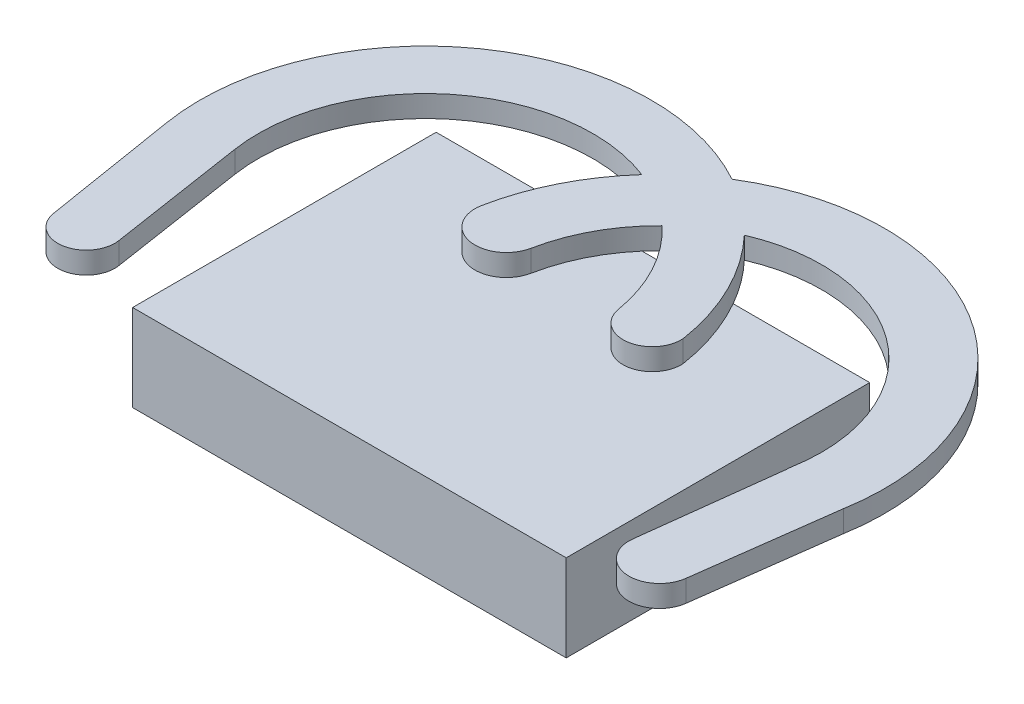
ISO-10303-21;
HEADER;
FILE_DESCRIPTION(('STEP AP214'),'2;1');
FILE_NAME('part.step','',(''),(''),'','','');
FILE_SCHEMA(('AUTOMOTIVE_DESIGN { 1 0 10303 214 1 1 1 1 }'));
ENDSEC;
DATA;
#1=APPLICATION_CONTEXT('core data for automotive mechanical design processes');
#2=APPLICATION_PROTOCOL_DEFINITION('international standard','automotive_design',2000,#1);
#3=PRODUCT_CONTEXT('',#1,'mechanical');
#4=PRODUCT('Part','Part','',(#3));
#5=PRODUCT_RELATED_PRODUCT_CATEGORY('part','',(#4));
#6=PRODUCT_DEFINITION_FORMATION('','',#4);
#7=PRODUCT_DEFINITION_CONTEXT('part definition',#1,'design');
#8=PRODUCT_DEFINITION('design','',#6,#7);
#9=PRODUCT_DEFINITION_SHAPE('','',#8);
#10=(LENGTH_UNIT() NAMED_UNIT(*) SI_UNIT(.MILLI.,.METRE.));
#11=(NAMED_UNIT(*) PLANE_ANGLE_UNIT() SI_UNIT($,.RADIAN.));
#12=(NAMED_UNIT(*) SI_UNIT($,.STERADIAN.) SOLID_ANGLE_UNIT());
#13=UNCERTAINTY_MEASURE_WITH_UNIT(LENGTH_MEASURE(1.E-05),#10,'distance_accuracy_value','');
#14=(GEOMETRIC_REPRESENTATION_CONTEXT(3) GLOBAL_UNCERTAINTY_ASSIGNED_CONTEXT((#13)) GLOBAL_UNIT_ASSIGNED_CONTEXT((#10,
#11,#12)) REPRESENTATION_CONTEXT('',''));
#15=CARTESIAN_POINT('',(0.,0.,0.));
#16=DIRECTION('',(0.,0.,1.));
#17=DIRECTION('',(1.,0.,0.));
#18=AXIS2_PLACEMENT_3D('',#15,#16,#17);
#19=CARTESIAN_POINT('',(-53.3576388888889,8.334375,44.45));
#20=DIRECTION('',(0.,-1.,0.));
#21=DIRECTION('',(0.,0.,-1.));
#22=AXIS2_PLACEMENT_3D('',#19,#20,#21);
#23=PLANE('',#22);
#24=CARTESIAN_POINT('',(-38.5417827969946,8.334375,16.3583791497795));
#25=DIRECTION('',(0.,1.,0.));
#26=DIRECTION('',(0.,0.,1.));
#27=AXIS2_PLACEMENT_3D('',#24,#25,#26);
#28=CIRCLE('',#27,33.02);
#29=CARTESIAN_POINT('',(-5.91865500174227,8.334375,11.2542697412113));
#30=VERTEX_POINT('',#29);
#31=CARTESIAN_POINT('',(-9.85861993806187,8.334375,0.));
#32=VERTEX_POINT('',#31);
#33=EDGE_CURVE('E52',#30,#32,#28,.T.);
#34=ORIENTED_EDGE('',*,*,#33,.F.);
#35=CARTESIAN_POINT('',(-10.1776388888889,8.334375,11.5329075698707));
#36=DIRECTION('',(0.,1.,0.));
#37=DIRECTION('',(0.,0.,1.));
#38=AXIS2_PLACEMENT_3D('',#35,#36,#37);
#39=CIRCLE('',#38,4.26808889206101);
#40=CARTESIAN_POINT('',(-14.3869493582025,8.334375,12.2388028620075));
#41=VERTEX_POINT('',#40);
#42=EDGE_CURVE('E57',#41,#30,#39,.T.);
#43=ORIENTED_EDGE('',*,*,#42,.F.);
#44=CARTESIAN_POINT('',(-38.5417827969946,8.334375,16.3583791497795));
#45=DIRECTION('',(0.,1.,0.));
#46=DIRECTION('',(0.,0.,1.));
#47=AXIS2_PLACEMENT_3D('',#44,#45,#46);
#48=CIRCLE('',#47,24.5036096778936);
#49=CARTESIAN_POINT('',(-20.2981450336915,8.334375,0.));
#50=VERTEX_POINT('',#49);
#51=EDGE_CURVE('E211',#41,#50,#48,.T.);
#52=ORIENTED_EDGE('',*,*,#51,.T.);
#53=DIRECTION('',(-1.,0.,0.));
#54=VECTOR('',#53,1.);
#55=CARTESIAN_POINT('',(-53.3576388888889,8.334375,0.));
#56=LINE('',#55,#54);
#57=CARTESIAN_POINT('',(-23.2028970645087,8.334375,0.));
#58=VERTEX_POINT('',#57);
#59=EDGE_CURVE('E313',#50,#58,#56,.T.);
#60=ORIENTED_EDGE('',*,*,#59,.T.);
#61=CARTESIAN_POINT('',(-5.16344485679907,8.334375,15.5315664983671));
#62=DIRECTION('',(0.,1.,0.));
#63=DIRECTION('',(0.,0.,1.));
#64=AXIS2_PLACEMENT_3D('',#61,#62,#63);
#65=CIRCLE('',#64,23.8044406329458);
#66=CARTESIAN_POINT('',(-28.5171141454815,8.334375,10.9209781842484));
#67=VERTEX_POINT('',#66);
#68=EDGE_CURVE('E11',#58,#67,#65,.T.);
#69=ORIENTED_EDGE('',*,*,#68,.T.);
#70=CARTESIAN_POINT('',(-33.0376388888889,8.334375,10.0285154924975));
#71=DIRECTION('',(0.,1.,0.));
#72=DIRECTION('',(0.,0.,1.));
#73=AXIS2_PLACEMENT_3D('',#70,#71,#72);
#74=CIRCLE('',#73,4.60777968352712);
#75=CARTESIAN_POINT('',(-37.5581636322962,8.334375,9.13605280074657));
#76=VERTEX_POINT('',#75);
#77=EDGE_CURVE('E271',#76,#67,#74,.T.);
#78=ORIENTED_EDGE('',*,*,#77,.F.);
#79=CARTESIAN_POINT('',(-5.16344485679907,8.334375,15.5315664983671));
#80=DIRECTION('',(0.,1.,0.));
#81=DIRECTION('',(0.,0.,1.));
#82=AXIS2_PLACEMENT_3D('',#79,#80,#81);
#83=CIRCLE('',#82,33.02);
#84=CARTESIAN_POINT('',(-34.3026082302867,8.334375,0.));
#85=VERTEX_POINT('',#84);
#86=EDGE_CURVE('E42',#85,#76,#83,.T.);
#87=ORIENTED_EDGE('',*,*,#86,.F.);
#88=CARTESIAN_POINT('',(-53.3576388888889,8.334375,0.));
#89=VERTEX_POINT('',#88);
#90=EDGE_CURVE('E311',#85,#89,#56,.T.);
#91=ORIENTED_EDGE('',*,*,#90,.T.);
#92=DIRECTION('',(0.,0.,-1.));
#93=VECTOR('',#92,1.);
#94=CARTESIAN_POINT('',(-53.3576388888889,8.334375,44.45));
#95=LINE('',#94,#93);
#96=CARTESIAN_POINT('',(-53.3576388888889,8.334375,44.45));
#97=VERTEX_POINT('',#96);
#98=EDGE_CURVE('E302',#97,#89,#95,.T.);
#99=ORIENTED_EDGE('',*,*,#98,.F.);
#100=DIRECTION('',(-1.,0.,0.));
#101=VECTOR('',#100,1.);
#102=CARTESIAN_POINT('',(-53.3576388888889,8.334375,44.45));
#103=LINE('',#102,#101);
#104=CARTESIAN_POINT('',(10.1423611111111,8.334375,44.45));
#105=VERTEX_POINT('',#104);
#106=EDGE_CURVE('E300',#105,#97,#103,.T.);
#107=ORIENTED_EDGE('',*,*,#106,.F.);
#108=DIRECTION('',(0.,0.,-1.));
#109=VECTOR('',#108,1.);
#110=CARTESIAN_POINT('',(10.1423611111111,8.334375,44.45));
#111=LINE('',#110,#109);
#112=CARTESIAN_POINT('',(10.1423611111111,8.334375,0.));
#113=VERTEX_POINT('',#112);
#114=EDGE_CURVE('E316',#105,#113,#111,.T.);
#115=ORIENTED_EDGE('',*,*,#114,.T.);
#116=EDGE_CURVE('E296',#113,#32,#56,.T.);
#117=ORIENTED_EDGE('',*,*,#116,.T.);
#118=EDGE_LOOP('',(#34,#43,#52,#60,#69,#78,#87,#91,#99,#107,#115,#117));
#119=FACE_BOUND('',#118,.T.);
#120=ADVANCED_FACE('F33',(#119),#23,.F.);
#121=CARTESIAN_POINT('',(-5.16344485679907,11.509375,15.5315664983671));
#122=DIRECTION('',(0.,-1.,0.));
#123=DIRECTION('',(0.,0.,-1.));
#124=AXIS2_PLACEMENT_3D('',#121,#122,#123);
#125=CYLINDRICAL_SURFACE('',#124,33.02);
#126=DIRECTION('',(0.,-1.,0.));
#127=VECTOR('',#126,1.);
#128=CARTESIAN_POINT('',(-22.5580957321595,9.921875,-12.5352559246348));
#129=LINE('',#128,#127);
#130=CARTESIAN_POINT('',(-22.5580957321595,11.509375,-12.5352559246348));
#131=VERTEX_POINT('',#130);
#132=CARTESIAN_POINT('',(-22.5580957321595,8.334375,-12.5352559246348));
#133=VERTEX_POINT('',#132);
#134=EDGE_CURVE('E228',#131,#133,#129,.T.);
#135=ORIENTED_EDGE('',*,*,#134,.F.);
#136=CARTESIAN_POINT('',(-5.16344485679907,11.509375,15.5315664983671));
#137=DIRECTION('',(0.,1.,0.));
#138=DIRECTION('',(0.,0.,1.));
#139=AXIS2_PLACEMENT_3D('',#136,#137,#138);
#140=CIRCLE('',#139,33.02);
#141=CARTESIAN_POINT('',(27.3842301492349,11.509375,21.0965688974315));
#142=VERTEX_POINT('',#141);
#143=EDGE_CURVE('E247',#142,#131,#140,.T.);
#144=ORIENTED_EDGE('',*,*,#143,.F.);
#145=DIRECTION('',(0.,-1.,0.));
#146=VECTOR('',#145,1.);
#147=CARTESIAN_POINT('',(27.3842301492349,11.509375,21.0965688974315));
#148=LINE('',#147,#146);
#149=CARTESIAN_POINT('',(27.3842301492349,8.334375,21.0965688974315));
#150=VERTEX_POINT('',#149);
#151=EDGE_CURVE('E282',#142,#150,#148,.T.);
#152=ORIENTED_EDGE('',*,*,#151,.T.);
#153=EDGE_CURVE('E269',#150,#133,#83,.T.);
#154=ORIENTED_EDGE('',*,*,#153,.T.);
#155=EDGE_LOOP('',(#135,#144,#152,#154));
#156=FACE_BOUND('',#155,.T.);
#157=ADVANCED_FACE('F425',(#156),#125,.T.);
#158=CARTESIAN_POINT('',(-5.16344485679907,11.509375,15.5315664983671));
#159=DIRECTION('',(0.,-1.,0.));
#160=DIRECTION('',(0.,0.,-1.));
#161=AXIS2_PLACEMENT_3D('',#158,#159,#160);
#162=CYLINDRICAL_SURFACE('',#161,23.8044406329458);
#163=CARTESIAN_POINT('',(-5.16344485679907,11.509375,15.5315664983671));
#164=DIRECTION('',(0.,1.,0.));
#165=DIRECTION('',(0.,0.,1.));
#166=AXIS2_PLACEMENT_3D('',#163,#164,#165);
#167=CIRCLE('',#166,23.8044406329458);
#168=CARTESIAN_POINT('',(18.3004920729873,11.509375,19.5434311025685));
#169=VERTEX_POINT('',#168);
#170=CARTESIAN_POINT('',(-14.5601822471133,11.509375,-6.33970964786885));
#171=VERTEX_POINT('',#170);
#172=EDGE_CURVE('E254',#169,#171,#167,.T.);
#173=ORIENTED_EDGE('',*,*,#172,.T.);
#174=DIRECTION('',(0.,-1.,0.));
#175=VECTOR('',#174,1.);
#176=CARTESIAN_POINT('',(-14.5601822471133,9.921875,-6.33970964786885));
#177=LINE('',#176,#175);
#178=CARTESIAN_POINT('',(-14.5601822471133,8.334375,-6.33970964786885));
#179=VERTEX_POINT('',#178);
#180=EDGE_CURVE('E197',#171,#179,#177,.T.);
#181=ORIENTED_EDGE('',*,*,#180,.T.);
#182=CARTESIAN_POINT('',(18.3004920729873,8.334375,19.5434311025685));
#183=VERTEX_POINT('',#182);
#184=EDGE_CURVE('E44',#183,#179,#65,.T.);
#185=ORIENTED_EDGE('',*,*,#184,.F.);
#186=DIRECTION('',(0.,-1.,0.));
#187=VECTOR('',#186,1.);
#188=CARTESIAN_POINT('',(18.3004920729873,11.509375,19.5434311025685));
#189=LINE('',#188,#187);
#190=EDGE_CURVE('E256',#169,#183,#189,.T.);
#191=ORIENTED_EDGE('',*,*,#190,.F.);
#192=EDGE_LOOP('',(#173,#181,#185,#191));
#193=FACE_BOUND('',#192,.T.);
#194=ADVANCED_FACE('F422',(#193),#162,.F.);
#195=CARTESIAN_POINT('',(-53.3576388888889,8.334375,44.45));
#196=DIRECTION('',(1.,0.,0.));
#197=DIRECTION('',(0.,0.,-1.));
#198=AXIS2_PLACEMENT_3D('',#195,#196,#197);
#199=PLANE('',#198);
#200=ORIENTED_EDGE('',*,*,#98,.T.);
#201=DIRECTION('',(0.,-1.,0.));
#202=VECTOR('',#201,1.);
#203=CARTESIAN_POINT('',(-53.3576388888889,8.334375,0.));
#204=LINE('',#203,#202);
#205=CARTESIAN_POINT('',(-53.3576388888889,-4.365625,0.));
#206=VERTEX_POINT('',#205);
#207=EDGE_CURVE('E291',#89,#206,#204,.T.);
#208=ORIENTED_EDGE('',*,*,#207,.T.);
#209=DIRECTION('',(0.,0.,-1.));
#210=VECTOR('',#209,1.);
#211=CARTESIAN_POINT('',(-53.3576388888889,-4.365625,44.45));
#212=LINE('',#211,#210);
#213=CARTESIAN_POINT('',(-53.3576388888889,-4.365625,44.45));
#214=VERTEX_POINT('',#213);
#215=EDGE_CURVE('E37',#214,#206,#212,.T.);
#216=ORIENTED_EDGE('',*,*,#215,.F.);
#217=DIRECTION('',(0.,-1.,0.));
#218=VECTOR('',#217,1.);
#219=CARTESIAN_POINT('',(-53.3576388888889,8.334375,44.45));
#220=LINE('',#219,#218);
#221=EDGE_CURVE('E292',#97,#214,#220,.T.);
#222=ORIENTED_EDGE('',*,*,#221,.F.);
#223=EDGE_LOOP('',(#200,#208,#216,#222));
#224=FACE_BOUND('',#223,.T.);
#225=ADVANCED_FACE('F35',(#224),#199,.F.);
#226=CARTESIAN_POINT('',(-53.3576388888889,-4.365625,44.45));
#227=DIRECTION('',(0.,1.,0.));
#228=DIRECTION('',(0.,0.,1.));
#229=AXIS2_PLACEMENT_3D('',#226,#227,#228);
#230=PLANE('',#229);
#231=ORIENTED_EDGE('',*,*,#215,.T.);
#232=DIRECTION('',(1.,0.,0.));
#233=VECTOR('',#232,1.);
#234=CARTESIAN_POINT('',(-53.3576388888889,-4.365625,0.));
#235=LINE('',#234,#233);
#236=CARTESIAN_POINT('',(10.1423611111111,-4.365625,0.));
#237=VERTEX_POINT('',#236);
#238=EDGE_CURVE('E305',#206,#237,#235,.T.);
#239=ORIENTED_EDGE('',*,*,#238,.T.);
#240=DIRECTION('',(0.,0.,-1.));
#241=VECTOR('',#240,1.);
#242=CARTESIAN_POINT('',(10.1423611111111,-4.365625,44.45));
#243=LINE('',#242,#241);
#244=CARTESIAN_POINT('',(10.1423611111111,-4.365625,44.45));
#245=VERTEX_POINT('',#244);
#246=EDGE_CURVE('E317',#245,#237,#243,.T.);
#247=ORIENTED_EDGE('',*,*,#246,.F.);
#248=DIRECTION('',(1.,0.,0.));
#249=VECTOR('',#248,1.);
#250=CARTESIAN_POINT('',(-53.3576388888889,-4.365625,44.45));
#251=LINE('',#250,#249);
#252=EDGE_CURVE('E295',#214,#245,#251,.T.);
#253=ORIENTED_EDGE('',*,*,#252,.F.);
#254=EDGE_LOOP('',(#231,#239,#247,#253));
#255=FACE_BOUND('',#254,.T.);
#256=ADVANCED_FACE('F438',(#255),#230,.F.);
#257=CARTESIAN_POINT('',(10.1423611111111,8.334375,44.45));
#258=DIRECTION('',(-1.,0.,0.));
#259=DIRECTION('',(0.,0.,1.));
#260=AXIS2_PLACEMENT_3D('',#257,#258,#259);
#261=PLANE('',#260);
#262=ORIENTED_EDGE('',*,*,#246,.T.);
#263=DIRECTION('',(0.,1.,0.));
#264=VECTOR('',#263,1.);
#265=CARTESIAN_POINT('',(10.1423611111111,8.334375,0.));
#266=LINE('',#265,#264);
#267=EDGE_CURVE('E308',#237,#113,#266,.T.);
#268=ORIENTED_EDGE('',*,*,#267,.T.);
#269=ORIENTED_EDGE('',*,*,#114,.F.);
#270=DIRECTION('',(0.,1.,0.));
#271=VECTOR('',#270,1.);
#272=CARTESIAN_POINT('',(10.1423611111111,8.334375,44.45));
#273=LINE('',#272,#271);
#274=EDGE_CURVE('E298',#245,#105,#273,.T.);
#275=ORIENTED_EDGE('',*,*,#274,.F.);
#276=EDGE_LOOP('',(#262,#268,#269,#275));
#277=FACE_BOUND('',#276,.T.);
#278=ADVANCED_FACE('F435',(#277),#261,.F.);
#279=CARTESIAN_POINT('',(0.,0.,44.45));
#280=DIRECTION('',(0.,0.,1.));
#281=DIRECTION('',(1.,0.,0.));
#282=AXIS2_PLACEMENT_3D('',#279,#280,#281);
#283=PLANE('',#282);
#284=ORIENTED_EDGE('',*,*,#221,.T.);
#285=ORIENTED_EDGE('',*,*,#252,.T.);
#286=ORIENTED_EDGE('',*,*,#274,.T.);
#287=ORIENTED_EDGE('',*,*,#106,.T.);
#288=EDGE_LOOP('',(#284,#285,#286,#287));
#289=FACE_BOUND('',#288,.T.);
#290=ADVANCED_FACE('F437',(#289),#283,.T.);
#291=CARTESIAN_POINT('',(0.,0.,0.));
#292=DIRECTION('',(0.,0.,1.));
#293=DIRECTION('',(1.,0.,0.));
#294=AXIS2_PLACEMENT_3D('',#291,#292,#293);
#295=PLANE('',#294);
#296=ORIENTED_EDGE('',*,*,#207,.F.);
#297=ORIENTED_EDGE('',*,*,#90,.F.);
#298=EDGE_CURVE('E314',#58,#85,#56,.T.);
#299=ORIENTED_EDGE('',*,*,#298,.F.);
#300=ORIENTED_EDGE('',*,*,#59,.F.);
#301=DIRECTION('',(-1.,0.,0.));
#302=VECTOR('',#301,1.);
#303=CARTESIAN_POINT('',(0.,8.334375,0.));
#304=LINE('',#303,#302);
#305=EDGE_CURVE('E231',#32,#50,#304,.T.);
#306=ORIENTED_EDGE('',*,*,#305,.F.);
#307=ORIENTED_EDGE('',*,*,#116,.F.);
#308=ORIENTED_EDGE('',*,*,#267,.F.);
#309=ORIENTED_EDGE('',*,*,#238,.F.);
#310=EDGE_LOOP('',(#296,#297,#299,#300,#306,#307,#308,#309));
#311=FACE_BOUND('',#310,.T.);
#312=ADVANCED_FACE('F339',(#311),#295,.F.);
#313=CARTESIAN_POINT('',(22.8423611111111,8.334375,20.32));
#314=DIRECTION('',(0.,1.,0.));
#315=DIRECTION('',(0.,0.,1.));
#316=AXIS2_PLACEMENT_3D('',#313,#314,#315);
#317=PLANE('',#316);
#318=CARTESIAN_POINT('',(-29.7474058596475,8.334375,-6.5126903820639));
#319=VERTEX_POINT('',#318);
#320=EDGE_CURVE('E268',#319,#85,#83,.T.);
#321=ORIENTED_EDGE('',*,*,#320,.F.);
#322=CARTESIAN_POINT('',(-62.7605606132925,8.334375,20.0836560967137));
#323=VERTEX_POINT('',#322);
#324=EDGE_CURVE('E398',#319,#323,#48,.T.);
#325=ORIENTED_EDGE('',*,*,#324,.T.);
#326=DIRECTION('',(0.152029721167777,0.,0.98837592235022));
#327=VECTOR('',#326,1.);
#328=CARTESIAN_POINT('',(-62.7605606132925,8.334375,20.0836560967137));
#329=LINE('',#328,#327);
#330=CARTESIAN_POINT('',(-59.6716310720777,8.334375,40.1654109070363));
#331=VERTEX_POINT('',#330);
#332=EDGE_CURVE('E399',#323,#331,#329,.T.);
#333=ORIENTED_EDGE('',*,*,#332,.T.);
#334=CARTESIAN_POINT('',(-63.7956629165143,8.334375,40.7997600420353));
#335=DIRECTION('',(0.,-1.,0.));
#336=DIRECTION('',(0.,0.,-1.));
#337=AXIS2_PLACEMENT_3D('',#334,#335,#336);
#338=CIRCLE('',#337,4.17253370016362);
#339=CARTESIAN_POINT('',(-67.9141652656307,8.334375,41.4690700444435));
#340=VERTEX_POINT('',#339);
#341=EDGE_CURVE('E358',#331,#340,#338,.T.);
#342=ORIENTED_EDGE('',*,*,#341,.T.);
#343=DIRECTION('',(0.160408531243726,0.,0.987050709489756));
#344=VECTOR('',#343,1.);
#345=CARTESIAN_POINT('',(-71.1341972243463,8.334375,21.6550688514473));
#346=LINE('',#345,#344);
#347=CARTESIAN_POINT('',(-71.1341972243463,8.334375,21.6550688514473));
#348=VERTEX_POINT('',#347);
#349=EDGE_CURVE('E356',#348,#340,#346,.T.);
#350=ORIENTED_EDGE('',*,*,#349,.F.);
#351=EDGE_CURVE('E354',#133,#348,#28,.T.);
#352=ORIENTED_EDGE('',*,*,#351,.F.);
#353=ORIENTED_EDGE('',*,*,#153,.F.);
#354=DIRECTION('',(-0.131271366589721,0.,0.991346472386757));
#355=VECTOR('',#354,1.);
#356=CARTESIAN_POINT('',(27.3842301492349,8.334375,21.0965688974315));
#357=LINE('',#356,#355);
#358=CARTESIAN_POINT('',(24.6862303977281,8.334375,41.471557028057));
#359=VERTEX_POINT('',#358);
#360=EDGE_CURVE('E265',#150,#359,#357,.T.);
#361=ORIENTED_EDGE('',*,*,#360,.T.);
#362=CARTESIAN_POINT('',(20.2485136919107,8.334375,40.883926817291));
#363=DIRECTION('',(0.,-1.,0.));
#364=DIRECTION('',(0.,0.,-1.));
#365=AXIS2_PLACEMENT_3D('',#362,#363,#364);
#366=CIRCLE('',#365,4.47645382258056);
#367=CARTESIAN_POINT('',(15.8107969860933,8.334375,40.2962966065251));
#368=VERTEX_POINT('',#367);
#369=EDGE_CURVE('E262',#359,#368,#366,.T.);
#370=ORIENTED_EDGE('',*,*,#369,.T.);
#371=DIRECTION('',(-0.120449649659599,0.,0.992719437654406));
#372=VECTOR('',#371,1.);
#373=CARTESIAN_POINT('',(18.234581427584,8.334375,20.32));
#374=LINE('',#373,#372);
#375=CARTESIAN_POINT('',(18.234581427584,8.334375,20.32));
#376=VERTEX_POINT('',#375);
#377=EDGE_CURVE('E259',#376,#368,#374,.T.);
#378=ORIENTED_EDGE('',*,*,#377,.F.);
#379=CARTESIAN_POINT('',(22.8423611111111,8.334375,20.32));
#380=DIRECTION('',(0.,1.,0.));
#381=DIRECTION('',(0.,0.,1.));
#382=AXIS2_PLACEMENT_3D('',#379,#380,#381);
#383=CIRCLE('',#382,4.60777968352712);
#384=EDGE_CURVE('E234',#183,#376,#383,.T.);
#385=ORIENTED_EDGE('',*,*,#384,.F.);
#386=ORIENTED_EDGE('',*,*,#184,.T.);
#387=EDGE_CURVE('E351',#32,#179,#28,.T.);
#388=ORIENTED_EDGE('',*,*,#387,.F.);
#389=ORIENTED_EDGE('',*,*,#305,.T.);
#390=CARTESIAN_POINT('',(-21.7791529130744,8.334375,-1.51453685800344));
#391=VERTEX_POINT('',#390);
#392=EDGE_CURVE('E397',#50,#391,#48,.T.);
#393=ORIENTED_EDGE('',*,*,#392,.T.);
#394=EDGE_CURVE('E45',#391,#58,#65,.T.);
#395=ORIENTED_EDGE('',*,*,#394,.T.);
#396=ORIENTED_EDGE('',*,*,#298,.T.);
#397=EDGE_LOOP('',(#321,#325,#333,#342,#350,#352,#353,#361,#370,#378,#385,#386,#388,#389,#393,
#395,#396));
#398=FACE_BOUND('',#397,.T.);
#399=ADVANCED_FACE('F342',(#398),#317,.F.);
#400=CARTESIAN_POINT('',(22.8423611111111,11.509375,20.32));
#401=DIRECTION('',(0.,-1.,0.));
#402=DIRECTION('',(0.,0.,-1.));
#403=AXIS2_PLACEMENT_3D('',#400,#401,#402);
#404=CYLINDRICAL_SURFACE('',#403,4.60777968352712);
#405=ORIENTED_EDGE('',*,*,#384,.T.);
#406=DIRECTION('',(0.,-1.,0.));
#407=VECTOR('',#406,1.);
#408=CARTESIAN_POINT('',(18.234581427584,11.509375,20.32));
#409=LINE('',#408,#407);
#410=CARTESIAN_POINT('',(18.234581427584,11.509375,20.32));
#411=VERTEX_POINT('',#410);
#412=EDGE_CURVE('E288',#411,#376,#409,.T.);
#413=ORIENTED_EDGE('',*,*,#412,.F.);
#414=CARTESIAN_POINT('',(22.8423611111111,11.509375,20.32));
#415=DIRECTION('',(0.,1.,0.));
#416=DIRECTION('',(0.,0.,1.));
#417=AXIS2_PLACEMENT_3D('',#414,#415,#416);
#418=CIRCLE('',#417,4.60777968352712);
#419=EDGE_CURVE('E235',#169,#411,#418,.T.);
#420=ORIENTED_EDGE('',*,*,#419,.F.);
#421=ORIENTED_EDGE('',*,*,#190,.T.);
#422=EDGE_LOOP('',(#405,#413,#420,#421));
#423=FACE_BOUND('',#422,.T.);
#424=ADVANCED_FACE('F455',(#423),#404,.T.);
#425=CARTESIAN_POINT('',(18.234581427584,11.509375,20.32));
#426=DIRECTION('',(0.992719437654406,0.,0.120449649659599));
#427=DIRECTION('',(0.120449649659599,0.,-0.992719437654406));
#428=AXIS2_PLACEMENT_3D('',#425,#426,#427);
#429=PLANE('',#428);
#430=ORIENTED_EDGE('',*,*,#377,.T.);
#431=DIRECTION('',(0.,-1.,0.));
#432=VECTOR('',#431,1.);
#433=CARTESIAN_POINT('',(15.8107969860933,11.509375,40.2962966065251));
#434=LINE('',#433,#432);
#435=CARTESIAN_POINT('',(15.8107969860933,11.509375,40.2962966065251));
#436=VERTEX_POINT('',#435);
#437=EDGE_CURVE('E286',#436,#368,#434,.T.);
#438=ORIENTED_EDGE('',*,*,#437,.F.);
#439=DIRECTION('',(-0.120449649659599,0.,0.992719437654406));
#440=VECTOR('',#439,1.);
#441=CARTESIAN_POINT('',(18.234581427584,11.509375,20.32));
#442=LINE('',#441,#440);
#443=EDGE_CURVE('E238',#411,#436,#442,.T.);
#444=ORIENTED_EDGE('',*,*,#443,.F.);
#445=ORIENTED_EDGE('',*,*,#412,.T.);
#446=EDGE_LOOP('',(#430,#438,#444,#445));
#447=FACE_BOUND('',#446,.T.);
#448=ADVANCED_FACE('F458',(#447),#429,.F.);
#449=CARTESIAN_POINT('',(20.2485136919107,11.509375,40.883926817291));
#450=DIRECTION('',(0.,-1.,0.));
#451=DIRECTION('',(0.,0.,-1.));
#452=AXIS2_PLACEMENT_3D('',#449,#450,#451);
#453=CYLINDRICAL_SURFACE('',#452,4.47645382258056);
#454=ORIENTED_EDGE('',*,*,#369,.F.);
#455=DIRECTION('',(0.,-1.,0.));
#456=VECTOR('',#455,1.);
#457=CARTESIAN_POINT('',(24.6862303977281,11.509375,41.471557028057));
#458=LINE('',#457,#456);
#459=CARTESIAN_POINT('',(24.6862303977281,11.509375,41.471557028057));
#460=VERTEX_POINT('',#459);
#461=EDGE_CURVE('E284',#460,#359,#458,.T.);
#462=ORIENTED_EDGE('',*,*,#461,.F.);
#463=CARTESIAN_POINT('',(20.2485136919107,11.509375,40.883926817291));
#464=DIRECTION('',(0.,-1.,0.));
#465=DIRECTION('',(0.,0.,-1.));
#466=AXIS2_PLACEMENT_3D('',#463,#464,#465);
#467=CIRCLE('',#466,4.47645382258056);
#468=EDGE_CURVE('E240',#460,#436,#467,.T.);
#469=ORIENTED_EDGE('',*,*,#468,.T.);
#470=ORIENTED_EDGE('',*,*,#437,.T.);
#471=EDGE_LOOP('',(#454,#462,#469,#470));
#472=FACE_BOUND('',#471,.T.);
#473=ADVANCED_FACE('F462',(#472),#453,.T.);
#474=CARTESIAN_POINT('',(27.3842301492349,11.509375,21.0965688974315));
#475=DIRECTION('',(0.991346472386757,0.,0.131271366589721));
#476=DIRECTION('',(0.131271366589721,0.,-0.991346472386757));
#477=AXIS2_PLACEMENT_3D('',#474,#475,#476);
#478=PLANE('',#477);
#479=ORIENTED_EDGE('',*,*,#360,.F.);
#480=ORIENTED_EDGE('',*,*,#151,.F.);
#481=DIRECTION('',(-0.131271366589721,0.,0.991346472386757));
#482=VECTOR('',#481,1.);
#483=CARTESIAN_POINT('',(27.3842301492349,11.509375,21.0965688974315));
#484=LINE('',#483,#482);
#485=EDGE_CURVE('E243',#142,#460,#484,.T.);
#486=ORIENTED_EDGE('',*,*,#485,.T.);
#487=ORIENTED_EDGE('',*,*,#461,.T.);
#488=EDGE_LOOP('',(#479,#480,#486,#487));
#489=FACE_BOUND('',#488,.T.);
#490=ADVANCED_FACE('F423',(#489),#478,.T.);
#491=CARTESIAN_POINT('',(-29.7474058596475,11.509375,-6.5126903820639));
#492=VERTEX_POINT('',#491);
#493=CARTESIAN_POINT('',(-37.5581636322962,11.509375,9.13605280074657));
#494=VERTEX_POINT('',#493);
#495=EDGE_CURVE('E246',#492,#494,#140,.T.);
#496=ORIENTED_EDGE('',*,*,#495,.F.);
#497=DIRECTION('',(0.,-1.,0.));
#498=VECTOR('',#497,1.);
#499=CARTESIAN_POINT('',(-29.7474058596475,9.921875,-6.5126903820639));
#500=LINE('',#499,#498);
#501=EDGE_CURVE('E218',#492,#319,#500,.T.);
#502=ORIENTED_EDGE('',*,*,#501,.T.);
#503=ORIENTED_EDGE('',*,*,#320,.T.);
#504=ORIENTED_EDGE('',*,*,#86,.T.);
#505=DIRECTION('',(0.,-1.,0.));
#506=VECTOR('',#505,1.);
#507=CARTESIAN_POINT('',(-37.5581636322962,11.509375,9.13605280074657));
#508=LINE('',#507,#506);
#509=EDGE_CURVE('E279',#494,#76,#508,.T.);
#510=ORIENTED_EDGE('',*,*,#509,.F.);
#511=EDGE_LOOP('',(#496,#502,#503,#504,#510));
#512=FACE_BOUND('',#511,.T.);
#513=ADVANCED_FACE('F328',(#512),#125,.T.);
#514=CARTESIAN_POINT('',(-33.0376388888889,11.509375,10.0285154924975));
#515=DIRECTION('',(0.,-1.,0.));
#516=DIRECTION('',(0.,0.,-1.));
#517=AXIS2_PLACEMENT_3D('',#514,#515,#516);
#518=CYLINDRICAL_SURFACE('',#517,4.60777968352712);
#519=ORIENTED_EDGE('',*,*,#77,.T.);
#520=DIRECTION('',(0.,-1.,0.));
#521=VECTOR('',#520,1.);
#522=CARTESIAN_POINT('',(-28.5171141454815,11.509375,10.9209781842484));
#523=LINE('',#522,#521);
#524=CARTESIAN_POINT('',(-28.5171141454815,11.509375,10.9209781842484));
#525=VERTEX_POINT('',#524);
#526=EDGE_CURVE('E276',#525,#67,#523,.T.);
#527=ORIENTED_EDGE('',*,*,#526,.F.);
#528=CARTESIAN_POINT('',(-33.0376388888889,11.509375,10.0285154924975));
#529=DIRECTION('',(0.,1.,0.));
#530=DIRECTION('',(0.,0.,1.));
#531=AXIS2_PLACEMENT_3D('',#528,#529,#530);
#532=CIRCLE('',#531,4.60777968352712);
#533=EDGE_CURVE('E250',#494,#525,#532,.T.);
#534=ORIENTED_EDGE('',*,*,#533,.F.);
#535=ORIENTED_EDGE('',*,*,#509,.T.);
#536=EDGE_LOOP('',(#519,#527,#534,#535));
#537=FACE_BOUND('',#536,.T.);
#538=ADVANCED_FACE('F414',(#537),#518,.T.);
#539=DIRECTION('',(0.,-1.,0.));
#540=VECTOR('',#539,1.);
#541=CARTESIAN_POINT('',(-21.7791529130744,9.921875,-1.51453685800344));
#542=LINE('',#541,#540);
#543=CARTESIAN_POINT('',(-21.7791529130744,11.509375,-1.51453685800344));
#544=VERTEX_POINT('',#543);
#545=EDGE_CURVE('E214',#544,#391,#542,.T.);
#546=ORIENTED_EDGE('',*,*,#545,.F.);
#547=EDGE_CURVE('E253',#544,#525,#167,.T.);
#548=ORIENTED_EDGE('',*,*,#547,.T.);
#549=ORIENTED_EDGE('',*,*,#526,.T.);
#550=ORIENTED_EDGE('',*,*,#68,.F.);
#551=ORIENTED_EDGE('',*,*,#394,.F.);
#552=EDGE_LOOP('',(#546,#548,#549,#550,#551));
#553=FACE_BOUND('',#552,.T.);
#554=ADVANCED_FACE('F410',(#553),#162,.F.);
#555=CARTESIAN_POINT('',(22.8423611111111,11.509375,20.32));
#556=DIRECTION('',(0.,1.,0.));
#557=DIRECTION('',(0.,0.,1.));
#558=AXIS2_PLACEMENT_3D('',#555,#556,#557);
#559=PLANE('',#558);
#560=ORIENTED_EDGE('',*,*,#547,.F.);
#561=CARTESIAN_POINT('',(-38.5417827969946,11.509375,16.3583791497795));
#562=DIRECTION('',(0.,1.,0.));
#563=DIRECTION('',(0.,0.,1.));
#564=AXIS2_PLACEMENT_3D('',#561,#562,#563);
#565=CIRCLE('',#564,24.5036096778936);
#566=CARTESIAN_POINT('',(-14.3869493582025,11.509375,12.2388028620075));
#567=VERTEX_POINT('',#566);
#568=EDGE_CURVE('E209',#567,#544,#565,.T.);
#569=ORIENTED_EDGE('',*,*,#568,.F.);
#570=CARTESIAN_POINT('',(-10.1776388888889,11.509375,11.5329075698707));
#571=DIRECTION('',(0.,1.,0.));
#572=DIRECTION('',(0.,0.,1.));
#573=AXIS2_PLACEMENT_3D('',#570,#571,#572);
#574=CIRCLE('',#573,4.26808889206101);
#575=CARTESIAN_POINT('',(-5.91865500174227,11.509375,11.2542697412113));
#576=VERTEX_POINT('',#575);
#577=EDGE_CURVE('E206',#567,#576,#574,.T.);
#578=ORIENTED_EDGE('',*,*,#577,.T.);
#579=CARTESIAN_POINT('',(-38.5417827969946,11.509375,16.3583791497795));
#580=DIRECTION('',(0.,1.,0.));
#581=DIRECTION('',(0.,0.,1.));
#582=AXIS2_PLACEMENT_3D('',#579,#580,#581);
#583=CIRCLE('',#582,33.02);
#584=EDGE_CURVE('E191',#576,#171,#583,.T.);
#585=ORIENTED_EDGE('',*,*,#584,.T.);
#586=ORIENTED_EDGE('',*,*,#172,.F.);
#587=ORIENTED_EDGE('',*,*,#419,.T.);
#588=ORIENTED_EDGE('',*,*,#443,.T.);
#589=ORIENTED_EDGE('',*,*,#468,.F.);
#590=ORIENTED_EDGE('',*,*,#485,.F.);
#591=ORIENTED_EDGE('',*,*,#143,.T.);
#592=CARTESIAN_POINT('',(-71.1341972243463,11.509375,21.6550688514473));
#593=VERTEX_POINT('',#592);
#594=EDGE_CURVE('E202',#131,#593,#583,.T.);
#595=ORIENTED_EDGE('',*,*,#594,.T.);
#596=DIRECTION('',(0.160408531243726,0.,0.987050709489756));
#597=VECTOR('',#596,1.);
#598=CARTESIAN_POINT('',(-71.1341972243463,11.509375,21.6550688514473));
#599=LINE('',#598,#597);
#600=CARTESIAN_POINT('',(-67.9141652656307,11.509375,41.4690700444435));
#601=VERTEX_POINT('',#600);
#602=EDGE_CURVE('E201',#593,#601,#599,.T.);
#603=ORIENTED_EDGE('',*,*,#602,.T.);
#604=CARTESIAN_POINT('',(-63.7956629165143,11.509375,40.7997600420353));
#605=DIRECTION('',(0.,-1.,0.));
#606=DIRECTION('',(0.,0.,-1.));
#607=AXIS2_PLACEMENT_3D('',#604,#605,#606);
#608=CIRCLE('',#607,4.17253370016362);
#609=CARTESIAN_POINT('',(-59.6716310720777,11.509375,40.1654109070363));
#610=VERTEX_POINT('',#609);
#611=EDGE_CURVE('E371',#610,#601,#608,.T.);
#612=ORIENTED_EDGE('',*,*,#611,.F.);
#613=DIRECTION('',(0.152029721167777,0.,0.98837592235022));
#614=VECTOR('',#613,1.);
#615=CARTESIAN_POINT('',(-62.7605606132925,11.509375,20.0836560967137));
#616=LINE('',#615,#614);
#617=CARTESIAN_POINT('',(-62.7605606132925,11.509375,20.0836560967137));
#618=VERTEX_POINT('',#617);
#619=EDGE_CURVE('E368',#618,#610,#616,.T.);
#620=ORIENTED_EDGE('',*,*,#619,.F.);
#621=EDGE_CURVE('E367',#492,#618,#565,.T.);
#622=ORIENTED_EDGE('',*,*,#621,.F.);
#623=ORIENTED_EDGE('',*,*,#495,.T.);
#624=ORIENTED_EDGE('',*,*,#533,.T.);
#625=EDGE_LOOP('',(#560,#569,#578,#585,#586,#587,#588,#589,#590,#591,#595,#603,#612,#620,#622,
#623,#624));
#626=FACE_BOUND('',#625,.T.);
#627=ADVANCED_FACE('F208',(#626),#559,.T.);
#628=CARTESIAN_POINT('',(-38.5417827969946,11.509375,16.3583791497795));
#629=DIRECTION('',(0.,-1.,0.));
#630=DIRECTION('',(0.,0.,-1.));
#631=AXIS2_PLACEMENT_3D('',#628,#629,#630);
#632=CYLINDRICAL_SURFACE('',#631,24.5036096778936);
#633=ORIENTED_EDGE('',*,*,#568,.T.);
#634=ORIENTED_EDGE('',*,*,#545,.T.);
#635=ORIENTED_EDGE('',*,*,#392,.F.);
#636=ORIENTED_EDGE('',*,*,#51,.F.);
#637=DIRECTION('',(0.,-1.,0.));
#638=VECTOR('',#637,1.);
#639=CARTESIAN_POINT('',(-14.3869493582025,11.509375,12.2388028620075));
#640=LINE('',#639,#638);
#641=EDGE_CURVE('E366',#567,#41,#640,.T.);
#642=ORIENTED_EDGE('',*,*,#641,.F.);
#643=EDGE_LOOP('',(#633,#634,#635,#636,#642));
#644=FACE_BOUND('',#643,.T.);
#645=ADVANCED_FACE('F408',(#644),#632,.F.);
#646=CARTESIAN_POINT('',(-38.5417827969946,11.509375,16.3583791497795));
#647=DIRECTION('',(0.,-1.,0.));
#648=DIRECTION('',(0.,0.,-1.));
#649=AXIS2_PLACEMENT_3D('',#646,#647,#648);
#650=CYLINDRICAL_SURFACE('',#649,33.02);
#651=ORIENTED_EDGE('',*,*,#180,.F.);
#652=ORIENTED_EDGE('',*,*,#584,.F.);
#653=DIRECTION('',(0.,-1.,0.));
#654=VECTOR('',#653,1.);
#655=CARTESIAN_POINT('',(-5.91865500174227,11.509375,11.2542697412113));
#656=LINE('',#655,#654);
#657=EDGE_CURVE('E195',#576,#30,#656,.T.);
#658=ORIENTED_EDGE('',*,*,#657,.T.);
#659=ORIENTED_EDGE('',*,*,#33,.T.);
#660=ORIENTED_EDGE('',*,*,#387,.T.);
#661=EDGE_LOOP('',(#651,#652,#658,#659,#660));
#662=FACE_BOUND('',#661,.T.);
#663=ADVANCED_FACE('F193',(#662),#650,.T.);
#664=CARTESIAN_POINT('',(-10.1776388888889,11.509375,11.5329075698707));
#665=DIRECTION('',(0.,-1.,0.));
#666=DIRECTION('',(0.,0.,-1.));
#667=AXIS2_PLACEMENT_3D('',#664,#665,#666);
#668=CYLINDRICAL_SURFACE('',#667,4.26808889206101);
#669=ORIENTED_EDGE('',*,*,#42,.T.);
#670=ORIENTED_EDGE('',*,*,#657,.F.);
#671=ORIENTED_EDGE('',*,*,#577,.F.);
#672=ORIENTED_EDGE('',*,*,#641,.T.);
#673=EDGE_LOOP('',(#669,#670,#671,#672));
#674=FACE_BOUND('',#673,.T.);
#675=ADVANCED_FACE('F213',(#674),#668,.T.);
#676=ORIENTED_EDGE('',*,*,#594,.F.);
#677=ORIENTED_EDGE('',*,*,#134,.T.);
#678=ORIENTED_EDGE('',*,*,#351,.T.);
#679=DIRECTION('',(0.,-1.,0.));
#680=VECTOR('',#679,1.);
#681=CARTESIAN_POINT('',(-71.1341972243463,11.509375,21.6550688514473));
#682=LINE('',#681,#680);
#683=EDGE_CURVE('E215',#593,#348,#682,.T.);
#684=ORIENTED_EDGE('',*,*,#683,.F.);
#685=EDGE_LOOP('',(#676,#677,#678,#684));
#686=FACE_BOUND('',#685,.T.);
#687=ADVANCED_FACE('F475',(#686),#650,.T.);
#688=ORIENTED_EDGE('',*,*,#501,.F.);
#689=ORIENTED_EDGE('',*,*,#621,.T.);
#690=DIRECTION('',(0.,-1.,0.));
#691=VECTOR('',#690,1.);
#692=CARTESIAN_POINT('',(-62.7605606132925,11.509375,20.0836560967137));
#693=LINE('',#692,#691);
#694=EDGE_CURVE('E390',#618,#323,#693,.T.);
#695=ORIENTED_EDGE('',*,*,#694,.T.);
#696=ORIENTED_EDGE('',*,*,#324,.F.);
#697=EDGE_LOOP('',(#688,#689,#695,#696));
#698=FACE_BOUND('',#697,.T.);
#699=ADVANCED_FACE('F405',(#698),#632,.F.);
#700=CARTESIAN_POINT('',(-71.1341972243463,11.509375,21.6550688514473));
#701=DIRECTION('',(0.987050709489756,0.,-0.160408531243726));
#702=DIRECTION('',(-0.160408531243726,0.,-0.987050709489756));
#703=AXIS2_PLACEMENT_3D('',#700,#701,#702);
#704=PLANE('',#703);
#705=ORIENTED_EDGE('',*,*,#349,.T.);
#706=DIRECTION('',(0.,-1.,0.));
#707=VECTOR('',#706,1.);
#708=CARTESIAN_POINT('',(-67.9141652656307,11.509375,41.4690700444435));
#709=LINE('',#708,#707);
#710=EDGE_CURVE('E221',#601,#340,#709,.T.);
#711=ORIENTED_EDGE('',*,*,#710,.F.);
#712=ORIENTED_EDGE('',*,*,#602,.F.);
#713=ORIENTED_EDGE('',*,*,#683,.T.);
#714=EDGE_LOOP('',(#705,#711,#712,#713));
#715=FACE_BOUND('',#714,.T.);
#716=ADVANCED_FACE('F380',(#715),#704,.F.);
#717=CARTESIAN_POINT('',(-63.7956629165143,11.509375,40.7997600420353));
#718=DIRECTION('',(0.,-1.,0.));
#719=DIRECTION('',(0.,0.,-1.));
#720=AXIS2_PLACEMENT_3D('',#717,#718,#719);
#721=CYLINDRICAL_SURFACE('',#720,4.17253370016362);
#722=ORIENTED_EDGE('',*,*,#341,.F.);
#723=DIRECTION('',(0.,-1.,0.));
#724=VECTOR('',#723,1.);
#725=CARTESIAN_POINT('',(-59.6716310720777,11.509375,40.1654109070363));
#726=LINE('',#725,#724);
#727=EDGE_CURVE('E385',#610,#331,#726,.T.);
#728=ORIENTED_EDGE('',*,*,#727,.F.);
#729=ORIENTED_EDGE('',*,*,#611,.T.);
#730=ORIENTED_EDGE('',*,*,#710,.T.);
#731=EDGE_LOOP('',(#722,#728,#729,#730));
#732=FACE_BOUND('',#731,.T.);
#733=ADVANCED_FACE('F386',(#732),#721,.T.);
#734=CARTESIAN_POINT('',(-62.7605606132925,11.509375,20.0836560967137));
#735=DIRECTION('',(0.98837592235022,0.,-0.152029721167777));
#736=DIRECTION('',(-0.152029721167777,0.,-0.98837592235022));
#737=AXIS2_PLACEMENT_3D('',#734,#735,#736);
#738=PLANE('',#737);
#739=ORIENTED_EDGE('',*,*,#332,.F.);
#740=ORIENTED_EDGE('',*,*,#694,.F.);
#741=ORIENTED_EDGE('',*,*,#619,.T.);
#742=ORIENTED_EDGE('',*,*,#727,.T.);
#743=EDGE_LOOP('',(#739,#740,#741,#742));
#744=FACE_BOUND('',#743,.T.);
#745=ADVANCED_FACE('F402',(#744),#738,.T.);
#746=CLOSED_SHELL('',(#120,#157,#194,#225,#256,#278,#290,#312,#399,#424,#448,#473,#490,#513,
#538,#554,#627,#645,#663,#675,#687,#699,#716,#733,#745));
#747=MANIFOLD_SOLID_BREP('B2',#746);
#748=ADVANCED_BREP_SHAPE_REPRESENTATION('',(#18,#747),#14);
#749=SHAPE_DEFINITION_REPRESENTATION(#9,#748);
ENDSEC;
END-ISO-10303-21;
